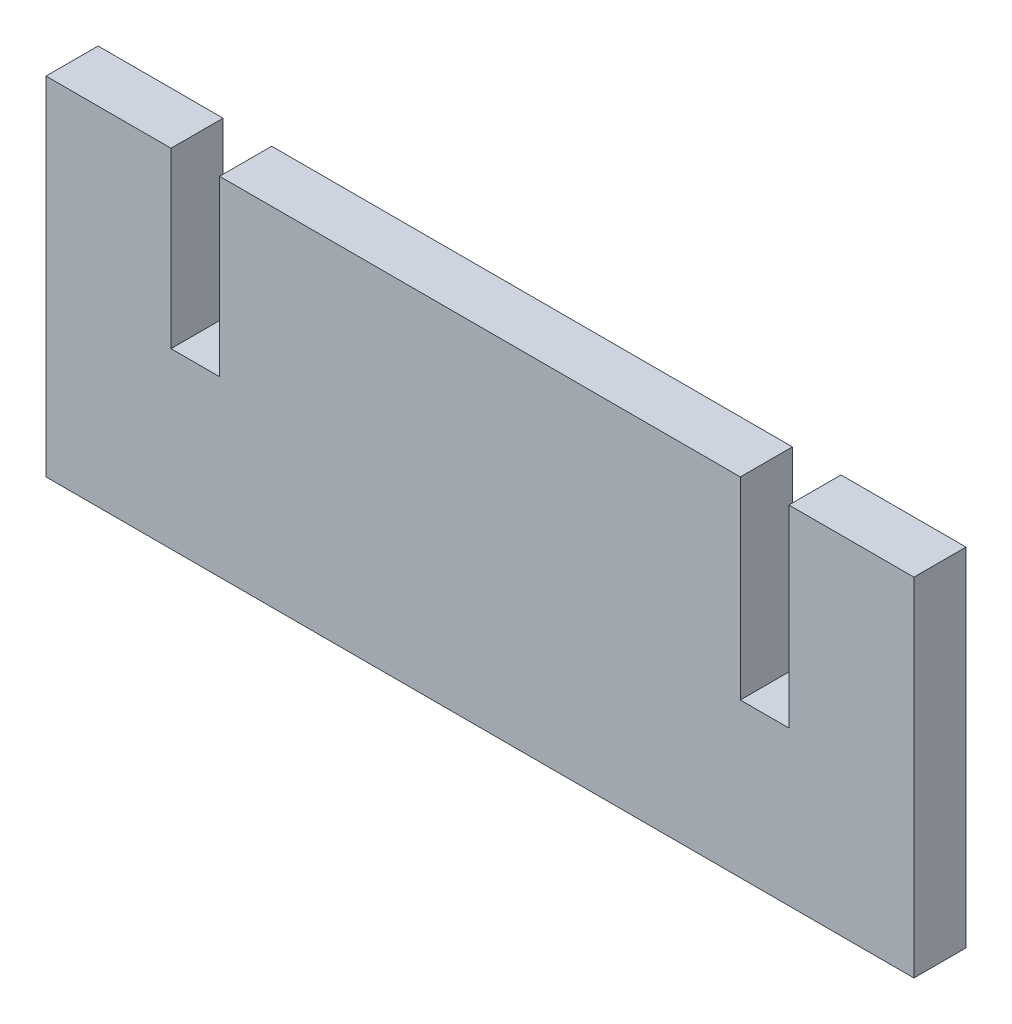
ISO-10303-21;
HEADER;
FILE_DESCRIPTION(('STEP AP214'),'2;1');
FILE_NAME('part.step','',(''),(''),'','','');
FILE_SCHEMA(('AUTOMOTIVE_DESIGN { 1 0 10303 214 1 1 1 1 }'));
ENDSEC;
DATA;
#1=APPLICATION_CONTEXT('core data for automotive mechanical design processes');
#2=APPLICATION_PROTOCOL_DEFINITION('international standard','automotive_design',2000,#1);
#3=PRODUCT_CONTEXT('',#1,'mechanical');
#4=PRODUCT('Part','Part','',(#3));
#5=PRODUCT_RELATED_PRODUCT_CATEGORY('part','',(#4));
#6=PRODUCT_DEFINITION_FORMATION('','',#4);
#7=PRODUCT_DEFINITION_CONTEXT('part definition',#1,'design');
#8=PRODUCT_DEFINITION('design','',#6,#7);
#9=PRODUCT_DEFINITION_SHAPE('','',#8);
#10=(LENGTH_UNIT() NAMED_UNIT(*) SI_UNIT(.MILLI.,.METRE.));
#11=(NAMED_UNIT(*) PLANE_ANGLE_UNIT() SI_UNIT($,.RADIAN.));
#12=(NAMED_UNIT(*) SI_UNIT($,.STERADIAN.) SOLID_ANGLE_UNIT());
#13=UNCERTAINTY_MEASURE_WITH_UNIT(LENGTH_MEASURE(1.E-05),#10,'distance_accuracy_value','');
#14=(GEOMETRIC_REPRESENTATION_CONTEXT(3) GLOBAL_UNCERTAINTY_ASSIGNED_CONTEXT((#13)) GLOBAL_UNIT_ASSIGNED_CONTEXT((#10,
#11,#12)) REPRESENTATION_CONTEXT('',''));
#15=CARTESIAN_POINT('',(0.,0.,0.));
#16=DIRECTION('',(0.,0.,1.));
#17=DIRECTION('',(1.,0.,0.));
#18=AXIS2_PLACEMENT_3D('',#15,#16,#17);
#19=CARTESIAN_POINT('',(0.,0.,3.));
#20=DIRECTION('',(1.,0.,0.));
#21=DIRECTION('',(0.,0.,-1.));
#22=AXIS2_PLACEMENT_3D('',#19,#20,#21);
#23=PLANE('',#22);
#24=DIRECTION('',(0.,-1.,0.));
#25=VECTOR('',#24,1.);
#26=CARTESIAN_POINT('',(0.,0.,0.));
#27=LINE('',#26,#25);
#28=CARTESIAN_POINT('',(0.,20.,0.));
#29=VERTEX_POINT('',#28);
#30=CARTESIAN_POINT('',(0.,0.,0.));
#31=VERTEX_POINT('',#30);
#32=EDGE_CURVE('E153',#29,#31,#27,.T.);
#33=ORIENTED_EDGE('',*,*,#32,.T.);
#34=DIRECTION('',(0.,0.,-1.));
#35=VECTOR('',#34,1.);
#36=CARTESIAN_POINT('',(0.,0.,3.));
#37=LINE('',#36,#35);
#38=CARTESIAN_POINT('',(0.,0.,3.));
#39=VERTEX_POINT('',#38);
#40=EDGE_CURVE('E11',#39,#31,#37,.T.);
#41=ORIENTED_EDGE('',*,*,#40,.F.);
#42=DIRECTION('',(0.,-1.,0.));
#43=VECTOR('',#42,1.);
#44=CARTESIAN_POINT('',(0.,0.,3.));
#45=LINE('',#44,#43);
#46=CARTESIAN_POINT('',(0.,20.,3.));
#47=VERTEX_POINT('',#46);
#48=EDGE_CURVE('E175',#47,#39,#45,.T.);
#49=ORIENTED_EDGE('',*,*,#48,.F.);
#50=DIRECTION('',(0.,0.,-1.));
#51=VECTOR('',#50,1.);
#52=CARTESIAN_POINT('',(0.,20.,3.));
#53=LINE('',#52,#51);
#54=EDGE_CURVE('E149',#47,#29,#53,.T.);
#55=ORIENTED_EDGE('',*,*,#54,.T.);
#56=EDGE_LOOP('',(#33,#41,#49,#55));
#57=FACE_BOUND('',#56,.T.);
#58=ADVANCED_FACE('F33',(#57),#23,.F.);
#59=CARTESIAN_POINT('',(0.,0.,3.));
#60=DIRECTION('',(0.,1.,0.));
#61=DIRECTION('',(0.,0.,1.));
#62=AXIS2_PLACEMENT_3D('',#59,#60,#61);
#63=PLANE('',#62);
#64=DIRECTION('',(1.,0.,0.));
#65=VECTOR('',#64,1.);
#66=CARTESIAN_POINT('',(0.,0.,0.));
#67=LINE('',#66,#65);
#68=CARTESIAN_POINT('',(50.,0.,0.));
#69=VERTEX_POINT('',#68);
#70=EDGE_CURVE('E156',#31,#69,#67,.T.);
#71=ORIENTED_EDGE('',*,*,#70,.T.);
#72=DIRECTION('',(0.,0.,-1.));
#73=VECTOR('',#72,1.);
#74=CARTESIAN_POINT('',(50.,0.,3.));
#75=LINE('',#74,#73);
#76=CARTESIAN_POINT('',(50.,0.,3.));
#77=VERTEX_POINT('',#76);
#78=EDGE_CURVE('E41',#77,#69,#75,.T.);
#79=ORIENTED_EDGE('',*,*,#78,.F.);
#80=DIRECTION('',(1.,0.,0.));
#81=VECTOR('',#80,1.);
#82=CARTESIAN_POINT('',(0.,0.,3.));
#83=LINE('',#82,#81);
#84=EDGE_CURVE('E104',#39,#77,#83,.T.);
#85=ORIENTED_EDGE('',*,*,#84,.F.);
#86=ORIENTED_EDGE('',*,*,#40,.T.);
#87=EDGE_LOOP('',(#71,#79,#85,#86));
#88=FACE_BOUND('',#87,.T.);
#89=ADVANCED_FACE('F253',(#88),#63,.F.);
#90=CARTESIAN_POINT('',(50.,0.,3.));
#91=DIRECTION('',(-1.,0.,0.));
#92=DIRECTION('',(0.,0.,1.));
#93=AXIS2_PLACEMENT_3D('',#90,#91,#92);
#94=PLANE('',#93);
#95=DIRECTION('',(0.,1.,0.));
#96=VECTOR('',#95,1.);
#97=CARTESIAN_POINT('',(50.,0.,0.));
#98=LINE('',#97,#96);
#99=CARTESIAN_POINT('',(50.,20.,0.));
#100=VERTEX_POINT('',#99);
#101=EDGE_CURVE('E158',#69,#100,#98,.T.);
#102=ORIENTED_EDGE('',*,*,#101,.T.);
#103=DIRECTION('',(0.,0.,-1.));
#104=VECTOR('',#103,1.);
#105=CARTESIAN_POINT('',(50.,20.,3.));
#106=LINE('',#105,#104);
#107=CARTESIAN_POINT('',(50.,20.,3.));
#108=VERTEX_POINT('',#107);
#109=EDGE_CURVE('E194',#108,#100,#106,.T.);
#110=ORIENTED_EDGE('',*,*,#109,.F.);
#111=DIRECTION('',(0.,1.,0.));
#112=VECTOR('',#111,1.);
#113=CARTESIAN_POINT('',(50.,0.,3.));
#114=LINE('',#113,#112);
#115=EDGE_CURVE('E202',#77,#108,#114,.T.);
#116=ORIENTED_EDGE('',*,*,#115,.F.);
#117=ORIENTED_EDGE('',*,*,#78,.T.);
#118=EDGE_LOOP('',(#102,#110,#116,#117));
#119=FACE_BOUND('',#118,.T.);
#120=ADVANCED_FACE('F200',(#119),#94,.F.);
#121=CARTESIAN_POINT('',(42.8,20.,3.));
#122=DIRECTION('',(0.,-1.,0.));
#123=DIRECTION('',(0.,0.,-1.));
#124=AXIS2_PLACEMENT_3D('',#121,#122,#123);
#125=PLANE('',#124);
#126=DIRECTION('',(-1.,0.,0.));
#127=VECTOR('',#126,1.);
#128=CARTESIAN_POINT('',(42.8,20.,0.));
#129=LINE('',#128,#127);
#130=CARTESIAN_POINT('',(42.8,20.,0.));
#131=VERTEX_POINT('',#130);
#132=EDGE_CURVE('E160',#100,#131,#129,.T.);
#133=ORIENTED_EDGE('',*,*,#132,.T.);
#134=DIRECTION('',(0.,0.,-1.));
#135=VECTOR('',#134,1.);
#136=CARTESIAN_POINT('',(42.8,20.,3.));
#137=LINE('',#136,#135);
#138=CARTESIAN_POINT('',(42.8,20.,3.));
#139=VERTEX_POINT('',#138);
#140=EDGE_CURVE('E191',#139,#131,#137,.T.);
#141=ORIENTED_EDGE('',*,*,#140,.F.);
#142=DIRECTION('',(-1.,0.,0.));
#143=VECTOR('',#142,1.);
#144=CARTESIAN_POINT('',(42.8,20.,3.));
#145=LINE('',#144,#143);
#146=EDGE_CURVE('E220',#108,#139,#145,.T.);
#147=ORIENTED_EDGE('',*,*,#146,.F.);
#148=ORIENTED_EDGE('',*,*,#109,.T.);
#149=EDGE_LOOP('',(#133,#141,#147,#148));
#150=FACE_BOUND('',#149,.T.);
#151=ADVANCED_FACE('F211',(#150),#125,.F.);
#152=CARTESIAN_POINT('',(42.8,20.,3.));
#153=DIRECTION('',(1.,0.,0.));
#154=DIRECTION('',(0.,0.,-1.));
#155=AXIS2_PLACEMENT_3D('',#152,#153,#154);
#156=PLANE('',#155);
#157=DIRECTION('',(0.,-1.,0.));
#158=VECTOR('',#157,1.);
#159=CARTESIAN_POINT('',(42.8,20.,0.));
#160=LINE('',#159,#158);
#161=CARTESIAN_POINT('',(42.8,8.86979600425123,0.));
#162=VERTEX_POINT('',#161);
#163=EDGE_CURVE('E162',#131,#162,#160,.T.);
#164=ORIENTED_EDGE('',*,*,#163,.T.);
#165=DIRECTION('',(0.,0.,-1.));
#166=VECTOR('',#165,1.);
#167=CARTESIAN_POINT('',(42.8,8.86979600425123,3.));
#168=LINE('',#167,#166);
#169=CARTESIAN_POINT('',(42.8,8.86979600425123,3.));
#170=VERTEX_POINT('',#169);
#171=EDGE_CURVE('E188',#170,#162,#168,.T.);
#172=ORIENTED_EDGE('',*,*,#171,.F.);
#173=DIRECTION('',(0.,-1.,0.));
#174=VECTOR('',#173,1.);
#175=CARTESIAN_POINT('',(42.8,20.,3.));
#176=LINE('',#175,#174);
#177=EDGE_CURVE('E217',#139,#170,#176,.T.);
#178=ORIENTED_EDGE('',*,*,#177,.F.);
#179=ORIENTED_EDGE('',*,*,#140,.T.);
#180=EDGE_LOOP('',(#164,#172,#178,#179));
#181=FACE_BOUND('',#180,.T.);
#182=ADVANCED_FACE('F215',(#181),#156,.F.);
#183=CARTESIAN_POINT('',(40.,8.86979600425123,3.));
#184=DIRECTION('',(0.,-1.,0.));
#185=DIRECTION('',(0.,0.,-1.));
#186=AXIS2_PLACEMENT_3D('',#183,#184,#185);
#187=PLANE('',#186);
#188=DIRECTION('',(-1.,0.,0.));
#189=VECTOR('',#188,1.);
#190=CARTESIAN_POINT('',(40.,8.86979600425123,0.));
#191=LINE('',#190,#189);
#192=CARTESIAN_POINT('',(40.,8.86979600425123,0.));
#193=VERTEX_POINT('',#192);
#194=EDGE_CURVE('E164',#162,#193,#191,.T.);
#195=ORIENTED_EDGE('',*,*,#194,.T.);
#196=DIRECTION('',(0.,0.,-1.));
#197=VECTOR('',#196,1.);
#198=CARTESIAN_POINT('',(40.,8.86979600425123,3.));
#199=LINE('',#198,#197);
#200=CARTESIAN_POINT('',(40.,8.86979600425123,3.));
#201=VERTEX_POINT('',#200);
#202=EDGE_CURVE('E185',#201,#193,#199,.T.);
#203=ORIENTED_EDGE('',*,*,#202,.F.);
#204=DIRECTION('',(-1.,0.,0.));
#205=VECTOR('',#204,1.);
#206=CARTESIAN_POINT('',(40.,8.86979600425123,3.));
#207=LINE('',#206,#205);
#208=EDGE_CURVE('E219',#170,#201,#207,.T.);
#209=ORIENTED_EDGE('',*,*,#208,.F.);
#210=ORIENTED_EDGE('',*,*,#171,.T.);
#211=EDGE_LOOP('',(#195,#203,#209,#210));
#212=FACE_BOUND('',#211,.T.);
#213=ADVANCED_FACE('F266',(#212),#187,.F.);
#214=CARTESIAN_POINT('',(40.,20.,3.));
#215=DIRECTION('',(-1.,0.,0.));
#216=DIRECTION('',(0.,0.,1.));
#217=AXIS2_PLACEMENT_3D('',#214,#215,#216);
#218=PLANE('',#217);
#219=DIRECTION('',(0.,1.,0.));
#220=VECTOR('',#219,1.);
#221=CARTESIAN_POINT('',(40.,20.,0.));
#222=LINE('',#221,#220);
#223=CARTESIAN_POINT('',(40.,20.,0.));
#224=VERTEX_POINT('',#223);
#225=EDGE_CURVE('E166',#193,#224,#222,.T.);
#226=ORIENTED_EDGE('',*,*,#225,.T.);
#227=DIRECTION('',(0.,0.,-1.));
#228=VECTOR('',#227,1.);
#229=CARTESIAN_POINT('',(40.,20.,3.));
#230=LINE('',#229,#228);
#231=CARTESIAN_POINT('',(40.,20.,3.));
#232=VERTEX_POINT('',#231);
#233=EDGE_CURVE('E182',#232,#224,#230,.T.);
#234=ORIENTED_EDGE('',*,*,#233,.F.);
#235=DIRECTION('',(0.,1.,0.));
#236=VECTOR('',#235,1.);
#237=CARTESIAN_POINT('',(40.,20.,3.));
#238=LINE('',#237,#236);
#239=EDGE_CURVE('E222',#201,#232,#238,.T.);
#240=ORIENTED_EDGE('',*,*,#239,.F.);
#241=ORIENTED_EDGE('',*,*,#202,.T.);
#242=EDGE_LOOP('',(#226,#234,#240,#241));
#243=FACE_BOUND('',#242,.T.);
#244=ADVANCED_FACE('F269',(#243),#218,.F.);
#245=CARTESIAN_POINT('',(10.,20.,3.));
#246=DIRECTION('',(0.,-1.,0.));
#247=DIRECTION('',(0.,0.,-1.));
#248=AXIS2_PLACEMENT_3D('',#245,#246,#247);
#249=PLANE('',#248);
#250=DIRECTION('',(-1.,0.,0.));
#251=VECTOR('',#250,1.);
#252=CARTESIAN_POINT('',(10.,20.,0.));
#253=LINE('',#252,#251);
#254=CARTESIAN_POINT('',(10.,20.,0.));
#255=VERTEX_POINT('',#254);
#256=EDGE_CURVE('E168',#224,#255,#253,.T.);
#257=ORIENTED_EDGE('',*,*,#256,.T.);
#258=DIRECTION('',(0.,0.,-1.));
#259=VECTOR('',#258,1.);
#260=CARTESIAN_POINT('',(10.,20.,3.));
#261=LINE('',#260,#259);
#262=CARTESIAN_POINT('',(10.,20.,3.));
#263=VERTEX_POINT('',#262);
#264=EDGE_CURVE('E179',#263,#255,#261,.T.);
#265=ORIENTED_EDGE('',*,*,#264,.F.);
#266=DIRECTION('',(-1.,0.,0.));
#267=VECTOR('',#266,1.);
#268=CARTESIAN_POINT('',(10.,20.,3.));
#269=LINE('',#268,#267);
#270=EDGE_CURVE('E228',#232,#263,#269,.T.);
#271=ORIENTED_EDGE('',*,*,#270,.F.);
#272=ORIENTED_EDGE('',*,*,#233,.T.);
#273=EDGE_LOOP('',(#257,#265,#271,#272));
#274=FACE_BOUND('',#273,.T.);
#275=ADVANCED_FACE('F234',(#274),#249,.F.);
#276=CARTESIAN_POINT('',(10.,20.,3.));
#277=DIRECTION('',(1.,0.,0.));
#278=DIRECTION('',(0.,1.,0.));
#279=AXIS2_PLACEMENT_3D('',#276,#277,#278);
#280=PLANE('',#279);
#281=DIRECTION('',(0.,-1.,0.));
#282=VECTOR('',#281,1.);
#283=CARTESIAN_POINT('',(10.,20.,0.));
#284=LINE('',#283,#282);
#285=CARTESIAN_POINT('',(10.,10.,0.));
#286=VERTEX_POINT('',#285);
#287=EDGE_CURVE('E170',#255,#286,#284,.T.);
#288=ORIENTED_EDGE('',*,*,#287,.T.);
#289=DIRECTION('',(0.,0.,-1.));
#290=VECTOR('',#289,1.);
#291=CARTESIAN_POINT('',(10.,10.,3.));
#292=LINE('',#291,#290);
#293=CARTESIAN_POINT('',(10.,10.,3.));
#294=VERTEX_POINT('',#293);
#295=EDGE_CURVE('E144',#294,#286,#292,.T.);
#296=ORIENTED_EDGE('',*,*,#295,.F.);
#297=DIRECTION('',(0.,-1.,0.));
#298=VECTOR('',#297,1.);
#299=CARTESIAN_POINT('',(10.,20.,3.));
#300=LINE('',#299,#298);
#301=EDGE_CURVE('E135',#263,#294,#300,.T.);
#302=ORIENTED_EDGE('',*,*,#301,.F.);
#303=ORIENTED_EDGE('',*,*,#264,.T.);
#304=EDGE_LOOP('',(#288,#296,#302,#303));
#305=FACE_BOUND('',#304,.T.);
#306=ADVANCED_FACE('F238',(#305),#280,.F.);
#307=CARTESIAN_POINT('',(7.2,10.,3.));
#308=DIRECTION('',(0.,-1.,0.));
#309=DIRECTION('',(0.,0.,-1.));
#310=AXIS2_PLACEMENT_3D('',#307,#308,#309);
#311=PLANE('',#310);
#312=DIRECTION('',(-1.,0.,0.));
#313=VECTOR('',#312,1.);
#314=CARTESIAN_POINT('',(7.2,10.,0.));
#315=LINE('',#314,#313);
#316=CARTESIAN_POINT('',(7.2,10.,0.));
#317=VERTEX_POINT('',#316);
#318=EDGE_CURVE('E143',#286,#317,#315,.T.);
#319=ORIENTED_EDGE('',*,*,#318,.T.);
#320=DIRECTION('',(0.,0.,-1.));
#321=VECTOR('',#320,1.);
#322=CARTESIAN_POINT('',(7.2,10.,3.));
#323=LINE('',#322,#321);
#324=CARTESIAN_POINT('',(7.2,10.,3.));
#325=VERTEX_POINT('',#324);
#326=EDGE_CURVE('E140',#325,#317,#323,.T.);
#327=ORIENTED_EDGE('',*,*,#326,.F.);
#328=DIRECTION('',(-1.,0.,0.));
#329=VECTOR('',#328,1.);
#330=CARTESIAN_POINT('',(7.2,10.,3.));
#331=LINE('',#330,#329);
#332=EDGE_CURVE('E129',#294,#325,#331,.T.);
#333=ORIENTED_EDGE('',*,*,#332,.F.);
#334=ORIENTED_EDGE('',*,*,#295,.T.);
#335=EDGE_LOOP('',(#319,#327,#333,#334));
#336=FACE_BOUND('',#335,.T.);
#337=ADVANCED_FACE('F141',(#336),#311,.F.);
#338=CARTESIAN_POINT('',(7.2,20.,3.));
#339=DIRECTION('',(-1.,0.,0.));
#340=DIRECTION('',(0.,-1.,0.));
#341=AXIS2_PLACEMENT_3D('',#338,#339,#340);
#342=PLANE('',#341);
#343=DIRECTION('',(0.,1.,0.));
#344=VECTOR('',#343,1.);
#345=CARTESIAN_POINT('',(7.2,20.,0.));
#346=LINE('',#345,#344);
#347=CARTESIAN_POINT('',(7.2,20.,0.));
#348=VERTEX_POINT('',#347);
#349=EDGE_CURVE('E90',#317,#348,#346,.T.);
#350=ORIENTED_EDGE('',*,*,#349,.T.);
#351=DIRECTION('',(0.,0.,-1.));
#352=VECTOR('',#351,1.);
#353=CARTESIAN_POINT('',(7.2,20.,3.));
#354=LINE('',#353,#352);
#355=CARTESIAN_POINT('',(7.2,20.,3.));
#356=VERTEX_POINT('',#355);
#357=EDGE_CURVE('E145',#356,#348,#354,.T.);
#358=ORIENTED_EDGE('',*,*,#357,.F.);
#359=DIRECTION('',(0.,1.,0.));
#360=VECTOR('',#359,1.);
#361=CARTESIAN_POINT('',(7.2,20.,3.));
#362=LINE('',#361,#360);
#363=EDGE_CURVE('E133',#325,#356,#362,.T.);
#364=ORIENTED_EDGE('',*,*,#363,.F.);
#365=ORIENTED_EDGE('',*,*,#326,.T.);
#366=EDGE_LOOP('',(#350,#358,#364,#365));
#367=FACE_BOUND('',#366,.T.);
#368=ADVANCED_FACE('F147',(#367),#342,.F.);
#369=CARTESIAN_POINT('',(0.,20.,3.));
#370=DIRECTION('',(0.,-1.,0.));
#371=DIRECTION('',(0.,0.,-1.));
#372=AXIS2_PLACEMENT_3D('',#369,#370,#371);
#373=PLANE('',#372);
#374=DIRECTION('',(-1.,0.,0.));
#375=VECTOR('',#374,1.);
#376=CARTESIAN_POINT('',(0.,20.,0.));
#377=LINE('',#376,#375);
#378=EDGE_CURVE('E96',#348,#29,#377,.T.);
#379=ORIENTED_EDGE('',*,*,#378,.T.);
#380=ORIENTED_EDGE('',*,*,#54,.F.);
#381=DIRECTION('',(-1.,0.,0.));
#382=VECTOR('',#381,1.);
#383=CARTESIAN_POINT('',(0.,20.,3.));
#384=LINE('',#383,#382);
#385=EDGE_CURVE('E49',#356,#47,#384,.T.);
#386=ORIENTED_EDGE('',*,*,#385,.F.);
#387=ORIENTED_EDGE('',*,*,#357,.T.);
#388=EDGE_LOOP('',(#379,#380,#386,#387));
#389=FACE_BOUND('',#388,.T.);
#390=ADVANCED_FACE('F242',(#389),#373,.F.);
#391=CARTESIAN_POINT('',(0.,0.,3.));
#392=DIRECTION('',(0.,0.,-1.));
#393=DIRECTION('',(-1.,0.,0.));
#394=AXIS2_PLACEMENT_3D('',#391,#392,#393);
#395=PLANE('',#394);
#396=ORIENTED_EDGE('',*,*,#48,.T.);
#397=ORIENTED_EDGE('',*,*,#84,.T.);
#398=ORIENTED_EDGE('',*,*,#115,.T.);
#399=ORIENTED_EDGE('',*,*,#146,.T.);
#400=ORIENTED_EDGE('',*,*,#177,.T.);
#401=ORIENTED_EDGE('',*,*,#208,.T.);
#402=ORIENTED_EDGE('',*,*,#239,.T.);
#403=ORIENTED_EDGE('',*,*,#270,.T.);
#404=ORIENTED_EDGE('',*,*,#301,.T.);
#405=ORIENTED_EDGE('',*,*,#332,.T.);
#406=ORIENTED_EDGE('',*,*,#363,.T.);
#407=ORIENTED_EDGE('',*,*,#385,.T.);
#408=EDGE_LOOP('',(#396,#397,#398,#399,#400,#401,#402,#403,#404,#405,#406,#407));
#409=FACE_BOUND('',#408,.T.);
#410=ADVANCED_FACE('F131',(#409),#395,.F.);
#411=CARTESIAN_POINT('',(0.,0.,0.));
#412=DIRECTION('',(0.,0.,-1.));
#413=DIRECTION('',(-1.,0.,0.));
#414=AXIS2_PLACEMENT_3D('',#411,#412,#413);
#415=PLANE('',#414);
#416=ORIENTED_EDGE('',*,*,#32,.F.);
#417=ORIENTED_EDGE('',*,*,#378,.F.);
#418=ORIENTED_EDGE('',*,*,#349,.F.);
#419=ORIENTED_EDGE('',*,*,#318,.F.);
#420=ORIENTED_EDGE('',*,*,#287,.F.);
#421=ORIENTED_EDGE('',*,*,#256,.F.);
#422=ORIENTED_EDGE('',*,*,#225,.F.);
#423=ORIENTED_EDGE('',*,*,#194,.F.);
#424=ORIENTED_EDGE('',*,*,#163,.F.);
#425=ORIENTED_EDGE('',*,*,#132,.F.);
#426=ORIENTED_EDGE('',*,*,#101,.F.);
#427=ORIENTED_EDGE('',*,*,#70,.F.);
#428=EDGE_LOOP('',(#416,#417,#418,#419,#420,#421,#422,#423,#424,#425,#426,#427));
#429=FACE_BOUND('',#428,.T.);
#430=ADVANCED_FACE('F206',(#429),#415,.T.);
#431=CLOSED_SHELL('',(#58,#89,#120,#151,#182,#213,#244,#275,#306,#337,#368,#390,#410,#430));
#432=MANIFOLD_SOLID_BREP('B2',#431);
#433=ADVANCED_BREP_SHAPE_REPRESENTATION('',(#18,#432),#14);
#434=SHAPE_DEFINITION_REPRESENTATION(#9,#433);
ENDSEC;
END-ISO-10303-21;
